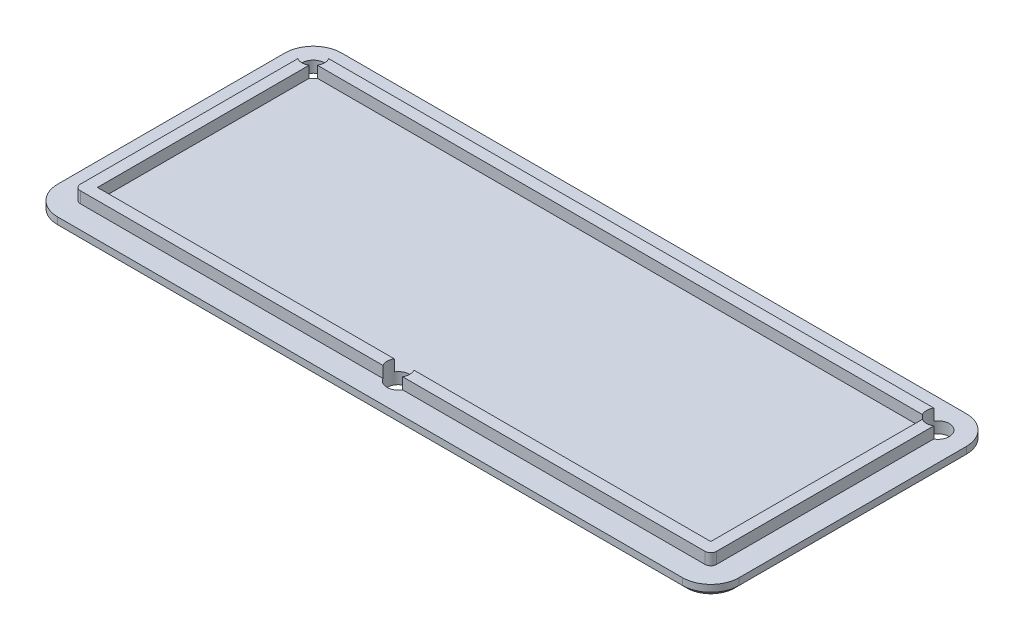
ISO-10303-21;
HEADER;
FILE_DESCRIPTION(('STEP AP214'),'2;1');
FILE_NAME('part.step','',(''),(''),'','','');
FILE_SCHEMA(('AUTOMOTIVE_DESIGN { 1 0 10303 214 1 1 1 1 }'));
ENDSEC;
DATA;
#1=APPLICATION_CONTEXT('core data for automotive mechanical design processes');
#2=APPLICATION_PROTOCOL_DEFINITION('international standard','automotive_design',2000,#1);
#3=PRODUCT_CONTEXT('',#1,'mechanical');
#4=PRODUCT('Part','Part','',(#3));
#5=PRODUCT_RELATED_PRODUCT_CATEGORY('part','',(#4));
#6=PRODUCT_DEFINITION_FORMATION('','',#4);
#7=PRODUCT_DEFINITION_CONTEXT('part definition',#1,'design');
#8=PRODUCT_DEFINITION('design','',#6,#7);
#9=PRODUCT_DEFINITION_SHAPE('','',#8);
#10=(LENGTH_UNIT() NAMED_UNIT(*) SI_UNIT(.MILLI.,.METRE.));
#11=(NAMED_UNIT(*) PLANE_ANGLE_UNIT() SI_UNIT($,.RADIAN.));
#12=(NAMED_UNIT(*) SI_UNIT($,.STERADIAN.) SOLID_ANGLE_UNIT());
#13=UNCERTAINTY_MEASURE_WITH_UNIT(LENGTH_MEASURE(1.E-05),#10,'distance_accuracy_value','');
#14=(GEOMETRIC_REPRESENTATION_CONTEXT(3) GLOBAL_UNCERTAINTY_ASSIGNED_CONTEXT((#13)) GLOBAL_UNIT_ASSIGNED_CONTEXT((#10,
#11,#12)) REPRESENTATION_CONTEXT('',''));
#15=CARTESIAN_POINT('',(0.,0.,0.));
#16=DIRECTION('',(0.,0.,1.));
#17=DIRECTION('',(1.,0.,0.));
#18=AXIS2_PLACEMENT_3D('',#15,#16,#17);
#19=CARTESIAN_POINT('',(34.925,2.54,-12.7));
#20=DIRECTION('',(0.,1.,0.));
#21=DIRECTION('',(0.,0.,1.));
#22=AXIS2_PLACEMENT_3D('',#19,#20,#21);
#23=PLANE('',#22);
#24=CARTESIAN_POINT('',(34.925,2.54,-12.7));
#25=DIRECTION('',(0.,-1.,0.));
#26=DIRECTION('',(0.,0.,-1.));
#27=AXIS2_PLACEMENT_3D('',#24,#25,#26);
#28=CIRCLE('',#27,1.27);
#29=CARTESIAN_POINT('',(33.8251477371938,2.54,-12.065));
#30=VERTEX_POINT('',#29);
#31=CARTESIAN_POINT('',(33.8251477371938,2.54,-13.335));
#32=VERTEX_POINT('',#31);
#33=EDGE_CURVE('E265',#30,#32,#28,.T.);
#34=ORIENTED_EDGE('',*,*,#33,.T.);
#35=DIRECTION('',(-1.,0.,0.));
#36=VECTOR('',#35,1.);
#37=CARTESIAN_POINT('',(34.925,2.54,-13.335));
#38=LINE('',#37,#36);
#39=CARTESIAN_POINT('',(-33.8251477371938,2.54,-13.335));
#40=VERTEX_POINT('',#39);
#41=EDGE_CURVE('E257',#32,#40,#38,.T.);
#42=ORIENTED_EDGE('',*,*,#41,.T.);
#43=CARTESIAN_POINT('',(-34.925,2.54,-12.7));
#44=DIRECTION('',(0.,-1.,0.));
#45=DIRECTION('',(0.,0.,-1.));
#46=AXIS2_PLACEMENT_3D('',#43,#44,#45);
#47=CIRCLE('',#46,1.27);
#48=CARTESIAN_POINT('',(-33.8251477371938,2.54,-12.065));
#49=VERTEX_POINT('',#48);
#50=EDGE_CURVE('E237',#40,#49,#47,.T.);
#51=ORIENTED_EDGE('',*,*,#50,.T.);
#52=DIRECTION('',(-1.,0.,0.));
#53=VECTOR('',#52,1.);
#54=CARTESIAN_POINT('',(34.29,2.54,-12.065));
#55=LINE('',#54,#53);
#56=EDGE_CURVE('E528',#30,#49,#55,.T.);
#57=ORIENTED_EDGE('',*,*,#56,.F.);
#58=EDGE_LOOP('',(#34,#42,#51,#57));
#59=FACE_BOUND('',#58,.T.);
#60=ADVANCED_FACE('F38',(#59),#23,.T.);
#61=CARTESIAN_POINT('',(35.56,2.54,-11.6001477371938));
#62=VERTEX_POINT('',#61);
#63=CARTESIAN_POINT('',(34.29,2.54,-11.6001477371938));
#64=VERTEX_POINT('',#63);
#65=EDGE_CURVE('E484',#62,#64,#28,.T.);
#66=ORIENTED_EDGE('',*,*,#65,.T.);
#67=DIRECTION('',(0.,0.,-1.));
#68=VECTOR('',#67,1.);
#69=CARTESIAN_POINT('',(34.29,2.54,12.065));
#70=LINE('',#69,#68);
#71=CARTESIAN_POINT('',(34.29,2.54,12.065));
#72=VERTEX_POINT('',#71);
#73=EDGE_CURVE('E524',#72,#64,#70,.T.);
#74=ORIENTED_EDGE('',*,*,#73,.F.);
#75=DIRECTION('',(1.,0.,0.));
#76=VECTOR('',#75,1.);
#77=CARTESIAN_POINT('',(-34.29,2.54,12.065));
#78=LINE('',#77,#76);
#79=CARTESIAN_POINT('',(1.09985226280624,2.54,12.065));
#80=VERTEX_POINT('',#79);
#81=EDGE_CURVE('E535',#80,#72,#78,.T.);
#82=ORIENTED_EDGE('',*,*,#81,.F.);
#83=CARTESIAN_POINT('',(0.,2.54,12.7));
#84=DIRECTION('',(0.,-1.,0.));
#85=DIRECTION('',(0.,0.,-1.));
#86=AXIS2_PLACEMENT_3D('',#83,#84,#85);
#87=CIRCLE('',#86,1.27);
#88=CARTESIAN_POINT('',(1.09985226280624,2.54,13.335));
#89=VERTEX_POINT('',#88);
#90=EDGE_CURVE('E600',#80,#89,#87,.T.);
#91=ORIENTED_EDGE('',*,*,#90,.T.);
#92=DIRECTION('',(1.,0.,0.));
#93=VECTOR('',#92,1.);
#94=CARTESIAN_POINT('',(-34.925,2.54,13.335));
#95=LINE('',#94,#93);
#96=CARTESIAN_POINT('',(34.925,2.54,13.335));
#97=VERTEX_POINT('',#96);
#98=EDGE_CURVE('E285',#89,#97,#95,.T.);
#99=ORIENTED_EDGE('',*,*,#98,.T.);
#100=CARTESIAN_POINT('',(34.925,2.54,12.7));
#101=DIRECTION('',(0.,1.,0.));
#102=DIRECTION('',(0.,0.,1.));
#103=AXIS2_PLACEMENT_3D('',#100,#101,#102);
#104=CIRCLE('',#103,0.634999999999998);
#105=CARTESIAN_POINT('',(35.56,2.54,12.7));
#106=VERTEX_POINT('',#105);
#107=EDGE_CURVE('E290',#97,#106,#104,.T.);
#108=ORIENTED_EDGE('',*,*,#107,.T.);
#109=DIRECTION('',(0.,0.,-1.));
#110=VECTOR('',#109,1.);
#111=CARTESIAN_POINT('',(35.56,2.54,12.7));
#112=LINE('',#111,#110);
#113=EDGE_CURVE('E293',#106,#62,#112,.T.);
#114=ORIENTED_EDGE('',*,*,#113,.T.);
#115=EDGE_LOOP('',(#66,#74,#82,#91,#99,#108,#114));
#116=FACE_BOUND('',#115,.T.);
#117=ADVANCED_FACE('F589',(#116),#23,.T.);
#118=CARTESIAN_POINT('',(-34.925,2.54,13.335));
#119=DIRECTION('',(0.,0.,-1.));
#120=DIRECTION('',(-1.,0.,0.));
#121=AXIS2_PLACEMENT_3D('',#118,#119,#120);
#122=PLANE('',#121);
#123=ORIENTED_EDGE('',*,*,#98,.F.);
#124=DIRECTION('',(0.,-1.,0.));
#125=VECTOR('',#124,1.);
#126=CARTESIAN_POINT('',(1.09985226280624,2.54,13.335));
#127=LINE('',#126,#125);
#128=CARTESIAN_POINT('',(1.09985226280624,1.27,13.335));
#129=VERTEX_POINT('',#128);
#130=EDGE_CURVE('E504',#89,#129,#127,.T.);
#131=ORIENTED_EDGE('',*,*,#130,.T.);
#132=DIRECTION('',(1.,0.,0.));
#133=VECTOR('',#132,1.);
#134=CARTESIAN_POINT('',(-34.925,1.27,13.335));
#135=LINE('',#134,#133);
#136=CARTESIAN_POINT('',(34.925,1.27,13.335));
#137=VERTEX_POINT('',#136);
#138=EDGE_CURVE('E306',#129,#137,#135,.T.);
#139=ORIENTED_EDGE('',*,*,#138,.T.);
#140=DIRECTION('',(0.,-1.,0.));
#141=VECTOR('',#140,1.);
#142=CARTESIAN_POINT('',(34.925,2.54,13.335));
#143=LINE('',#142,#141);
#144=EDGE_CURVE('E316',#97,#137,#143,.T.);
#145=ORIENTED_EDGE('',*,*,#144,.F.);
#146=EDGE_LOOP('',(#123,#131,#139,#145));
#147=FACE_BOUND('',#146,.T.);
#148=ADVANCED_FACE('F630',(#147),#122,.F.);
#149=CARTESIAN_POINT('',(-34.29,2.54,12.065));
#150=DIRECTION('',(0.,0.,-1.));
#151=DIRECTION('',(-1.,0.,0.));
#152=AXIS2_PLACEMENT_3D('',#149,#150,#151);
#153=PLANE('',#152);
#154=DIRECTION('',(0.,-1.,0.));
#155=VECTOR('',#154,1.);
#156=CARTESIAN_POINT('',(1.09985226280624,2.54,12.065));
#157=LINE('',#156,#155);
#158=CARTESIAN_POINT('',(1.09985226280624,1.27,12.065));
#159=VERTEX_POINT('',#158);
#160=EDGE_CURVE('E494',#80,#159,#157,.T.);
#161=ORIENTED_EDGE('',*,*,#160,.F.);
#162=ORIENTED_EDGE('',*,*,#81,.T.);
#163=DIRECTION('',(0.,-1.,0.));
#164=VECTOR('',#163,1.);
#165=CARTESIAN_POINT('',(34.29,2.54,12.065));
#166=LINE('',#165,#164);
#167=CARTESIAN_POINT('',(34.29,1.27,12.065));
#168=VERTEX_POINT('',#167);
#169=EDGE_CURVE('E540',#72,#168,#166,.T.);
#170=ORIENTED_EDGE('',*,*,#169,.T.);
#171=DIRECTION('',(1.,0.,0.));
#172=VECTOR('',#171,1.);
#173=CARTESIAN_POINT('',(-34.29,1.27,12.065));
#174=LINE('',#173,#172);
#175=EDGE_CURVE('E550',#159,#168,#174,.T.);
#176=ORIENTED_EDGE('',*,*,#175,.F.);
#177=EDGE_LOOP('',(#161,#162,#170,#176));
#178=FACE_BOUND('',#177,.T.);
#179=ADVANCED_FACE('F637',(#178),#153,.T.);
#180=CARTESIAN_POINT('',(0.,1.27,0.));
#181=DIRECTION('',(0.,1.,0.));
#182=DIRECTION('',(0.,0.,1.));
#183=AXIS2_PLACEMENT_3D('',#180,#181,#182);
#184=PLANE('',#183);
#185=CARTESIAN_POINT('',(34.925,1.27,-12.7));
#186=DIRECTION('',(0.,1.,0.));
#187=DIRECTION('',(0.,0.,1.));
#188=AXIS2_PLACEMENT_3D('',#185,#186,#187);
#189=CIRCLE('',#188,1.27);
#190=CARTESIAN_POINT('',(35.56,1.27,-11.6001477371938));
#191=VERTEX_POINT('',#190);
#192=CARTESIAN_POINT('',(33.8251477371938,1.27,-13.335));
#193=VERTEX_POINT('',#192);
#194=EDGE_CURVE('E518',#191,#193,#189,.T.);
#195=ORIENTED_EDGE('',*,*,#194,.F.);
#196=DIRECTION('',(0.,0.,-1.));
#197=VECTOR('',#196,1.);
#198=CARTESIAN_POINT('',(35.56,1.27,12.7));
#199=LINE('',#198,#197);
#200=CARTESIAN_POINT('',(35.56,1.27,12.7));
#201=VERTEX_POINT('',#200);
#202=EDGE_CURVE('E268',#201,#191,#199,.T.);
#203=ORIENTED_EDGE('',*,*,#202,.F.);
#204=CARTESIAN_POINT('',(34.925,1.27,12.7));
#205=DIRECTION('',(0.,1.,0.));
#206=DIRECTION('',(0.,0.,1.));
#207=AXIS2_PLACEMENT_3D('',#204,#205,#206);
#208=CIRCLE('',#207,0.634999999999998);
#209=EDGE_CURVE('E277',#137,#201,#208,.T.);
#210=ORIENTED_EDGE('',*,*,#209,.F.);
#211=ORIENTED_EDGE('',*,*,#138,.F.);
#212=CARTESIAN_POINT('',(0.,1.27,12.7));
#213=DIRECTION('',(0.,1.,0.));
#214=DIRECTION('',(0.,0.,1.));
#215=AXIS2_PLACEMENT_3D('',#212,#213,#214);
#216=CIRCLE('',#215,1.27);
#217=CARTESIAN_POINT('',(-1.09985226280624,1.27,13.335));
#218=VERTEX_POINT('',#217);
#219=EDGE_CURVE('E501',#218,#129,#216,.T.);
#220=ORIENTED_EDGE('',*,*,#219,.F.);
#221=CARTESIAN_POINT('',(-34.925,1.27,13.335));
#222=VERTEX_POINT('',#221);
#223=EDGE_CURVE('E307',#222,#218,#135,.T.);
#224=ORIENTED_EDGE('',*,*,#223,.F.);
#225=CARTESIAN_POINT('',(-34.925,1.27,12.7));
#226=DIRECTION('',(0.,1.,0.));
#227=DIRECTION('',(0.,0.,1.));
#228=AXIS2_PLACEMENT_3D('',#225,#226,#227);
#229=CIRCLE('',#228,0.634999999999998);
#230=CARTESIAN_POINT('',(-35.56,1.27,12.7));
#231=VERTEX_POINT('',#230);
#232=EDGE_CURVE('E303',#231,#222,#229,.T.);
#233=ORIENTED_EDGE('',*,*,#232,.F.);
#234=DIRECTION('',(0.,0.,1.));
#235=VECTOR('',#234,1.);
#236=CARTESIAN_POINT('',(-35.56,1.27,-12.7));
#237=LINE('',#236,#235);
#238=CARTESIAN_POINT('',(-35.56,1.27,-11.6001477371938));
#239=VERTEX_POINT('',#238);
#240=EDGE_CURVE('E300',#239,#231,#237,.T.);
#241=ORIENTED_EDGE('',*,*,#240,.F.);
#242=CARTESIAN_POINT('',(-34.925,1.27,-12.7));
#243=DIRECTION('',(0.,1.,0.));
#244=DIRECTION('',(0.,0.,1.));
#245=AXIS2_PLACEMENT_3D('',#242,#243,#244);
#246=CIRCLE('',#245,1.27);
#247=CARTESIAN_POINT('',(-33.8251477371938,1.27,-13.335));
#248=VERTEX_POINT('',#247);
#249=EDGE_CURVE('E262',#248,#239,#246,.T.);
#250=ORIENTED_EDGE('',*,*,#249,.F.);
#251=DIRECTION('',(-1.,0.,0.));
#252=VECTOR('',#251,1.);
#253=CARTESIAN_POINT('',(34.925,1.27,-13.335));
#254=LINE('',#253,#252);
#255=EDGE_CURVE('E259',#193,#248,#254,.T.);
#256=ORIENTED_EDGE('',*,*,#255,.F.);
#257=EDGE_LOOP('',(#195,#203,#210,#211,#220,#224,#233,#241,#250,#256));
#258=FACE_BOUND('',#257,.T.);
#259=DIRECTION('',(-1.,0.,0.));
#260=VECTOR('',#259,1.);
#261=CARTESIAN_POINT('',(-38.1,1.27,-15.875));
#262=LINE('',#261,#260);
#263=CARTESIAN_POINT('',(34.925,1.27,-15.875));
#264=VERTEX_POINT('',#263);
#265=CARTESIAN_POINT('',(-34.925,1.27,-15.875));
#266=VERTEX_POINT('',#265);
#267=EDGE_CURVE('E340',#264,#266,#262,.T.);
#268=ORIENTED_EDGE('',*,*,#267,.T.);
#269=CARTESIAN_POINT('',(-34.925,1.27,-12.7));
#270=DIRECTION('',(0.,1.,0.));
#271=DIRECTION('',(0.,0.,1.));
#272=AXIS2_PLACEMENT_3D('',#269,#270,#271);
#273=CIRCLE('',#272,3.175);
#274=CARTESIAN_POINT('',(-38.1,1.27,-12.7));
#275=VERTEX_POINT('',#274);
#276=EDGE_CURVE('E367',#266,#275,#273,.T.);
#277=ORIENTED_EDGE('',*,*,#276,.T.);
#278=DIRECTION('',(0.,0.,1.));
#279=VECTOR('',#278,1.);
#280=CARTESIAN_POINT('',(-38.1,1.27,-15.875));
#281=LINE('',#280,#279);
#282=CARTESIAN_POINT('',(-38.1,1.27,12.7));
#283=VERTEX_POINT('',#282);
#284=EDGE_CURVE('E328',#275,#283,#281,.T.);
#285=ORIENTED_EDGE('',*,*,#284,.T.);
#286=CARTESIAN_POINT('',(-34.925,1.27,12.7));
#287=DIRECTION('',(0.,1.,0.));
#288=DIRECTION('',(0.,0.,1.));
#289=AXIS2_PLACEMENT_3D('',#286,#287,#288);
#290=CIRCLE('',#289,3.175);
#291=CARTESIAN_POINT('',(-34.925,1.27,15.875));
#292=VERTEX_POINT('',#291);
#293=EDGE_CURVE('E358',#283,#292,#290,.T.);
#294=ORIENTED_EDGE('',*,*,#293,.T.);
#295=DIRECTION('',(1.,0.,0.));
#296=VECTOR('',#295,1.);
#297=CARTESIAN_POINT('',(-38.1,1.27,15.875));
#298=LINE('',#297,#296);
#299=CARTESIAN_POINT('',(34.925,1.27,15.875));
#300=VERTEX_POINT('',#299);
#301=EDGE_CURVE('E332',#292,#300,#298,.T.);
#302=ORIENTED_EDGE('',*,*,#301,.T.);
#303=CARTESIAN_POINT('',(34.925,1.27,12.7));
#304=DIRECTION('',(0.,1.,0.));
#305=DIRECTION('',(0.,0.,1.));
#306=AXIS2_PLACEMENT_3D('',#303,#304,#305);
#307=CIRCLE('',#306,3.175);
#308=CARTESIAN_POINT('',(38.1,1.27,12.7));
#309=VERTEX_POINT('',#308);
#310=EDGE_CURVE('E361',#300,#309,#307,.T.);
#311=ORIENTED_EDGE('',*,*,#310,.T.);
#312=DIRECTION('',(0.,0.,-1.));
#313=VECTOR('',#312,1.);
#314=CARTESIAN_POINT('',(38.1,1.27,-15.875));
#315=LINE('',#314,#313);
#316=CARTESIAN_POINT('',(38.1,1.27,-12.7));
#317=VERTEX_POINT('',#316);
#318=EDGE_CURVE('E336',#309,#317,#315,.T.);
#319=ORIENTED_EDGE('',*,*,#318,.T.);
#320=CARTESIAN_POINT('',(34.925,1.27,-12.7));
#321=DIRECTION('',(0.,1.,0.));
#322=DIRECTION('',(0.,0.,1.));
#323=AXIS2_PLACEMENT_3D('',#320,#321,#322);
#324=CIRCLE('',#323,3.175);
#325=EDGE_CURVE('E364',#317,#264,#324,.T.);
#326=ORIENTED_EDGE('',*,*,#325,.T.);
#327=EDGE_LOOP('',(#268,#277,#285,#294,#302,#311,#319,#326));
#328=FACE_BOUND('',#327,.T.);
#329=ADVANCED_FACE('F623',(#258,#328),#184,.T.);
#330=CARTESIAN_POINT('',(-38.1,1.27,-15.875));
#331=DIRECTION('',(1.,0.,0.));
#332=DIRECTION('',(0.,0.,-1.));
#333=AXIS2_PLACEMENT_3D('',#330,#331,#332);
#334=PLANE('',#333);
#335=DIRECTION('',(0.,-1.,0.));
#336=VECTOR('',#335,1.);
#337=CARTESIAN_POINT('',(-38.1,1.27,-12.7));
#338=LINE('',#337,#336);
#339=CARTESIAN_POINT('',(-38.1,0.508000000000002,-12.7));
#340=VERTEX_POINT('',#339);
#341=EDGE_CURVE('E347',#275,#340,#338,.T.);
#342=ORIENTED_EDGE('',*,*,#341,.T.);
#343=DIRECTION('',(0.,0.,1.));
#344=VECTOR('',#343,1.);
#345=CARTESIAN_POINT('',(-38.1,0.508000000000002,-15.875));
#346=LINE('',#345,#344);
#347=CARTESIAN_POINT('',(-38.1,0.508000000000002,12.7));
#348=VERTEX_POINT('',#347);
#349=EDGE_CURVE('E427',#340,#348,#346,.T.);
#350=ORIENTED_EDGE('',*,*,#349,.T.);
#351=DIRECTION('',(0.,-1.,0.));
#352=VECTOR('',#351,1.);
#353=CARTESIAN_POINT('',(-38.1,1.27,12.7));
#354=LINE('',#353,#352);
#355=EDGE_CURVE('E344',#348,#283,#354,.F.);
#356=ORIENTED_EDGE('',*,*,#355,.T.);
#357=ORIENTED_EDGE('',*,*,#284,.F.);
#358=EDGE_LOOP('',(#342,#350,#356,#357));
#359=FACE_BOUND('',#358,.T.);
#360=ADVANCED_FACE('F645',(#359),#334,.F.);
#361=CARTESIAN_POINT('',(-38.1,1.27,15.875));
#362=DIRECTION('',(0.,0.,-1.));
#363=DIRECTION('',(-1.,0.,0.));
#364=AXIS2_PLACEMENT_3D('',#361,#362,#363);
#365=PLANE('',#364);
#366=DIRECTION('',(0.,-1.,0.));
#367=VECTOR('',#366,1.);
#368=CARTESIAN_POINT('',(-34.925,1.27,15.875));
#369=LINE('',#368,#367);
#370=CARTESIAN_POINT('',(-34.925,0.508000000000002,15.875));
#371=VERTEX_POINT('',#370);
#372=EDGE_CURVE('E377',#292,#371,#369,.T.);
#373=ORIENTED_EDGE('',*,*,#372,.T.);
#374=DIRECTION('',(1.,0.,0.));
#375=VECTOR('',#374,1.);
#376=CARTESIAN_POINT('',(-38.1,0.508000000000002,15.875));
#377=LINE('',#376,#375);
#378=CARTESIAN_POINT('',(34.925,0.508000000000002,15.875));
#379=VERTEX_POINT('',#378);
#380=EDGE_CURVE('E11',#371,#379,#377,.T.);
#381=ORIENTED_EDGE('',*,*,#380,.T.);
#382=DIRECTION('',(0.,-1.,0.));
#383=VECTOR('',#382,1.);
#384=CARTESIAN_POINT('',(34.925,1.27,15.875));
#385=LINE('',#384,#383);
#386=EDGE_CURVE('E380',#379,#300,#385,.F.);
#387=ORIENTED_EDGE('',*,*,#386,.T.);
#388=ORIENTED_EDGE('',*,*,#301,.F.);
#389=EDGE_LOOP('',(#373,#381,#387,#388));
#390=FACE_BOUND('',#389,.T.);
#391=ADVANCED_FACE('F750',(#390),#365,.F.);
#392=CARTESIAN_POINT('',(38.1,1.27,-15.875));
#393=DIRECTION('',(-1.,0.,0.));
#394=DIRECTION('',(0.,0.,1.));
#395=AXIS2_PLACEMENT_3D('',#392,#393,#394);
#396=PLANE('',#395);
#397=DIRECTION('',(0.,-1.,0.));
#398=VECTOR('',#397,1.);
#399=CARTESIAN_POINT('',(38.1,1.27,12.7));
#400=LINE('',#399,#398);
#401=CARTESIAN_POINT('',(38.1,0.508000000000001,12.7));
#402=VERTEX_POINT('',#401);
#403=EDGE_CURVE('E370',#309,#402,#400,.T.);
#404=ORIENTED_EDGE('',*,*,#403,.T.);
#405=DIRECTION('',(0.,0.,-1.));
#406=VECTOR('',#405,1.);
#407=CARTESIAN_POINT('',(38.1,0.508000000000002,-15.875));
#408=LINE('',#407,#406);
#409=CARTESIAN_POINT('',(38.1,0.508000000000002,-12.7));
#410=VERTEX_POINT('',#409);
#411=EDGE_CURVE('E430',#402,#410,#408,.T.);
#412=ORIENTED_EDGE('',*,*,#411,.T.);
#413=DIRECTION('',(0.,-1.,0.));
#414=VECTOR('',#413,1.);
#415=CARTESIAN_POINT('',(38.1,1.27,-12.7));
#416=LINE('',#415,#414);
#417=EDGE_CURVE('E374',#410,#317,#416,.F.);
#418=ORIENTED_EDGE('',*,*,#417,.T.);
#419=ORIENTED_EDGE('',*,*,#318,.F.);
#420=EDGE_LOOP('',(#404,#412,#418,#419));
#421=FACE_BOUND('',#420,.T.);
#422=ADVANCED_FACE('F723',(#421),#396,.F.);
#423=CARTESIAN_POINT('',(-38.1,1.27,-15.875));
#424=DIRECTION('',(0.,0.,1.));
#425=DIRECTION('',(1.,0.,0.));
#426=AXIS2_PLACEMENT_3D('',#423,#424,#425);
#427=PLANE('',#426);
#428=DIRECTION('',(0.,-1.,0.));
#429=VECTOR('',#428,1.);
#430=CARTESIAN_POINT('',(34.925,1.27,-15.875));
#431=LINE('',#430,#429);
#432=CARTESIAN_POINT('',(34.925,0.508000000000002,-15.875));
#433=VERTEX_POINT('',#432);
#434=EDGE_CURVE('E351',#264,#433,#431,.T.);
#435=ORIENTED_EDGE('',*,*,#434,.T.);
#436=DIRECTION('',(-1.,0.,0.));
#437=VECTOR('',#436,1.);
#438=CARTESIAN_POINT('',(-38.1,0.508000000000002,-15.875));
#439=LINE('',#438,#437);
#440=CARTESIAN_POINT('',(-34.925,0.508000000000001,-15.875));
#441=VERTEX_POINT('',#440);
#442=EDGE_CURVE('E392',#433,#441,#439,.T.);
#443=ORIENTED_EDGE('',*,*,#442,.T.);
#444=DIRECTION('',(0.,-1.,0.));
#445=VECTOR('',#444,1.);
#446=CARTESIAN_POINT('',(-34.925,1.27,-15.875));
#447=LINE('',#446,#445);
#448=EDGE_CURVE('E355',#441,#266,#447,.F.);
#449=ORIENTED_EDGE('',*,*,#448,.T.);
#450=ORIENTED_EDGE('',*,*,#267,.F.);
#451=EDGE_LOOP('',(#435,#443,#449,#450));
#452=FACE_BOUND('',#451,.T.);
#453=ADVANCED_FACE('F732',(#452),#427,.F.);
#454=CARTESIAN_POINT('',(0.,0.,0.));
#455=DIRECTION('',(0.,1.,0.));
#456=DIRECTION('',(0.,0.,1.));
#457=AXIS2_PLACEMENT_3D('',#454,#455,#456);
#458=PLANE('',#457);
#459=CARTESIAN_POINT('',(-34.925,0.,-12.7));
#460=DIRECTION('',(0.,1.,0.));
#461=DIRECTION('',(0.,0.,1.));
#462=AXIS2_PLACEMENT_3D('',#459,#460,#461);
#463=CIRCLE('',#462,2.66699999999999);
#464=CARTESIAN_POINT('',(-37.592,0.,-12.7));
#465=VERTEX_POINT('',#464);
#466=CARTESIAN_POINT('',(-34.925,0.,-15.367));
#467=VERTEX_POINT('',#466);
#468=EDGE_CURVE('E414',#465,#467,#463,.F.);
#469=ORIENTED_EDGE('',*,*,#468,.T.);
#470=DIRECTION('',(1.,0.,0.));
#471=VECTOR('',#470,1.);
#472=CARTESIAN_POINT('',(0.,0.,-15.367));
#473=LINE('',#472,#471);
#474=CARTESIAN_POINT('',(34.925,0.,-15.367));
#475=VERTEX_POINT('',#474);
#476=EDGE_CURVE('E417',#467,#475,#473,.T.);
#477=ORIENTED_EDGE('',*,*,#476,.T.);
#478=CARTESIAN_POINT('',(34.925,0.,-12.7));
#479=DIRECTION('',(0.,1.,0.));
#480=DIRECTION('',(0.,0.,1.));
#481=AXIS2_PLACEMENT_3D('',#478,#479,#480);
#482=CIRCLE('',#481,2.66699999999999);
#483=CARTESIAN_POINT('',(37.592,0.,-12.7));
#484=VERTEX_POINT('',#483);
#485=EDGE_CURVE('E411',#475,#484,#482,.F.);
#486=ORIENTED_EDGE('',*,*,#485,.T.);
#487=DIRECTION('',(0.,0.,1.));
#488=VECTOR('',#487,1.);
#489=CARTESIAN_POINT('',(37.592,0.,0.));
#490=LINE('',#489,#488);
#491=CARTESIAN_POINT('',(37.592,0.,12.7));
#492=VERTEX_POINT('',#491);
#493=EDGE_CURVE('E405',#484,#492,#490,.T.);
#494=ORIENTED_EDGE('',*,*,#493,.T.);
#495=CARTESIAN_POINT('',(34.925,0.,12.7));
#496=DIRECTION('',(0.,1.,0.));
#497=DIRECTION('',(0.,0.,1.));
#498=AXIS2_PLACEMENT_3D('',#495,#496,#497);
#499=CIRCLE('',#498,2.66699999999999);
#500=CARTESIAN_POINT('',(34.925,0.,15.367));
#501=VERTEX_POINT('',#500);
#502=EDGE_CURVE('E399',#492,#501,#499,.F.);
#503=ORIENTED_EDGE('',*,*,#502,.T.);
#504=DIRECTION('',(-1.,0.,0.));
#505=VECTOR('',#504,1.);
#506=CARTESIAN_POINT('',(0.,0.,15.367));
#507=LINE('',#506,#505);
#508=CARTESIAN_POINT('',(-34.925,0.,15.367));
#509=VERTEX_POINT('',#508);
#510=EDGE_CURVE('E396',#501,#509,#507,.T.);
#511=ORIENTED_EDGE('',*,*,#510,.T.);
#512=CARTESIAN_POINT('',(-34.925,0.,12.7));
#513=DIRECTION('',(0.,1.,0.));
#514=DIRECTION('',(0.,0.,1.));
#515=AXIS2_PLACEMENT_3D('',#512,#513,#514);
#516=CIRCLE('',#515,2.66699999999999);
#517=CARTESIAN_POINT('',(-37.592,0.,12.7));
#518=VERTEX_POINT('',#517);
#519=EDGE_CURVE('E402',#509,#518,#516,.F.);
#520=ORIENTED_EDGE('',*,*,#519,.T.);
#521=DIRECTION('',(0.,0.,-1.));
#522=VECTOR('',#521,1.);
#523=CARTESIAN_POINT('',(-37.592,0.,0.));
#524=LINE('',#523,#522);
#525=EDGE_CURVE('E408',#518,#465,#524,.T.);
#526=ORIENTED_EDGE('',*,*,#525,.T.);
#527=EDGE_LOOP('',(#469,#477,#486,#494,#503,#511,#520,#526));
#528=FACE_BOUND('',#527,.T.);
#529=CARTESIAN_POINT('',(34.925,0.,-12.7));
#530=DIRECTION('',(0.,-1.,0.));
#531=DIRECTION('',(0.,0.,-1.));
#532=AXIS2_PLACEMENT_3D('',#529,#530,#531);
#533=CIRCLE('',#532,1.27);
#534=CARTESIAN_POINT('',(34.925,0.,-13.97));
#535=VERTEX_POINT('',#534);
#536=EDGE_CURVE('E595',#535,#535,#533,.T.);
#537=ORIENTED_EDGE('',*,*,#536,.F.);
#538=EDGE_LOOP('',(#537));
#539=FACE_BOUND('',#538,.T.);
#540=CARTESIAN_POINT('',(0.,0.,12.7));
#541=DIRECTION('',(0.,-1.,0.));
#542=DIRECTION('',(0.,0.,-1.));
#543=AXIS2_PLACEMENT_3D('',#540,#541,#542);
#544=CIRCLE('',#543,1.27);
#545=CARTESIAN_POINT('',(0.,0.,11.43));
#546=VERTEX_POINT('',#545);
#547=EDGE_CURVE('E249',#546,#546,#544,.T.);
#548=ORIENTED_EDGE('',*,*,#547,.F.);
#549=EDGE_LOOP('',(#548));
#550=FACE_BOUND('',#549,.T.);
#551=CARTESIAN_POINT('',(-34.925,0.,-12.7));
#552=DIRECTION('',(0.,-1.,0.));
#553=DIRECTION('',(0.,0.,-1.));
#554=AXIS2_PLACEMENT_3D('',#551,#552,#553);
#555=CIRCLE('',#554,1.27);
#556=CARTESIAN_POINT('',(-34.925,0.,-13.97));
#557=VERTEX_POINT('',#556);
#558=EDGE_CURVE('E467',#557,#557,#555,.T.);
#559=ORIENTED_EDGE('',*,*,#558,.F.);
#560=EDGE_LOOP('',(#559));
#561=FACE_BOUND('',#560,.T.);
#562=ADVANCED_FACE('F713',(#528,#539,#550,#561),#458,.F.);
#563=CARTESIAN_POINT('',(-34.925,1.27,-12.7));
#564=DIRECTION('',(0.,-1.,0.));
#565=DIRECTION('',(0.,0.,-1.));
#566=AXIS2_PLACEMENT_3D('',#563,#564,#565);
#567=CYLINDRICAL_SURFACE('',#566,3.175);
#568=ORIENTED_EDGE('',*,*,#448,.F.);
#569=CARTESIAN_POINT('',(-34.925,0.508000000000001,-12.7));
#570=DIRECTION('',(0.,1.,0.));
#571=DIRECTION('',(0.,0.,1.));
#572=AXIS2_PLACEMENT_3D('',#569,#570,#571);
#573=CIRCLE('',#572,3.175);
#574=EDGE_CURVE('E421',#441,#340,#573,.T.);
#575=ORIENTED_EDGE('',*,*,#574,.T.);
#576=ORIENTED_EDGE('',*,*,#341,.F.);
#577=ORIENTED_EDGE('',*,*,#276,.F.);
#578=EDGE_LOOP('',(#568,#575,#576,#577));
#579=FACE_BOUND('',#578,.T.);
#580=ADVANCED_FACE('F737',(#579),#567,.T.);
#581=CARTESIAN_POINT('',(34.925,1.27,-12.7));
#582=DIRECTION('',(0.,-1.,0.));
#583=DIRECTION('',(0.,0.,-1.));
#584=AXIS2_PLACEMENT_3D('',#581,#582,#583);
#585=CYLINDRICAL_SURFACE('',#584,3.175);
#586=ORIENTED_EDGE('',*,*,#417,.F.);
#587=CARTESIAN_POINT('',(34.925,0.508000000000002,-12.7));
#588=DIRECTION('',(0.,1.,0.));
#589=DIRECTION('',(0.,0.,1.));
#590=AXIS2_PLACEMENT_3D('',#587,#588,#589);
#591=CIRCLE('',#590,3.175);
#592=EDGE_CURVE('E424',#410,#433,#591,.T.);
#593=ORIENTED_EDGE('',*,*,#592,.T.);
#594=ORIENTED_EDGE('',*,*,#434,.F.);
#595=ORIENTED_EDGE('',*,*,#325,.F.);
#596=EDGE_LOOP('',(#586,#593,#594,#595));
#597=FACE_BOUND('',#596,.T.);
#598=ADVANCED_FACE('F671',(#597),#585,.T.);
#599=CARTESIAN_POINT('',(34.925,1.27,12.7));
#600=DIRECTION('',(0.,-1.,0.));
#601=DIRECTION('',(0.,0.,-1.));
#602=AXIS2_PLACEMENT_3D('',#599,#600,#601);
#603=CYLINDRICAL_SURFACE('',#602,3.175);
#604=ORIENTED_EDGE('',*,*,#386,.F.);
#605=CARTESIAN_POINT('',(34.925,0.508000000000001,12.7));
#606=DIRECTION('',(0.,1.,0.));
#607=DIRECTION('',(0.,0.,1.));
#608=AXIS2_PLACEMENT_3D('',#605,#606,#607);
#609=CIRCLE('',#608,3.175);
#610=EDGE_CURVE('E48',#379,#402,#609,.T.);
#611=ORIENTED_EDGE('',*,*,#610,.T.);
#612=ORIENTED_EDGE('',*,*,#403,.F.);
#613=ORIENTED_EDGE('',*,*,#310,.F.);
#614=EDGE_LOOP('',(#604,#611,#612,#613));
#615=FACE_BOUND('',#614,.T.);
#616=ADVANCED_FACE('F666',(#615),#603,.T.);
#617=CARTESIAN_POINT('',(-34.925,1.27,12.7));
#618=DIRECTION('',(0.,-1.,0.));
#619=DIRECTION('',(0.,0.,-1.));
#620=AXIS2_PLACEMENT_3D('',#617,#618,#619);
#621=CYLINDRICAL_SURFACE('',#620,3.175);
#622=ORIENTED_EDGE('',*,*,#355,.F.);
#623=CARTESIAN_POINT('',(-34.925,0.508000000000002,12.7));
#624=DIRECTION('',(0.,1.,0.));
#625=DIRECTION('',(0.,0.,1.));
#626=AXIS2_PLACEMENT_3D('',#623,#624,#625);
#627=CIRCLE('',#626,3.175);
#628=EDGE_CURVE('E62',#348,#371,#627,.T.);
#629=ORIENTED_EDGE('',*,*,#628,.T.);
#630=ORIENTED_EDGE('',*,*,#372,.F.);
#631=ORIENTED_EDGE('',*,*,#293,.F.);
#632=EDGE_LOOP('',(#622,#629,#630,#631));
#633=FACE_BOUND('',#632,.T.);
#634=ADVANCED_FACE('F659',(#633),#621,.T.);
#635=CARTESIAN_POINT('',(-1.09985226280624,2.54,13.335));
#636=VERTEX_POINT('',#635);
#637=CARTESIAN_POINT('',(-1.09985226280624,2.54,12.065));
#638=VERTEX_POINT('',#637);
#639=EDGE_CURVE('E603',#636,#638,#87,.T.);
#640=ORIENTED_EDGE('',*,*,#639,.T.);
#641=CARTESIAN_POINT('',(-34.29,2.54,12.065));
#642=VERTEX_POINT('',#641);
#643=EDGE_CURVE('E536',#642,#638,#78,.T.);
#644=ORIENTED_EDGE('',*,*,#643,.F.);
#645=DIRECTION('',(0.,0.,1.));
#646=VECTOR('',#645,1.);
#647=CARTESIAN_POINT('',(-34.29,2.54,-12.065));
#648=LINE('',#647,#646);
#649=CARTESIAN_POINT('',(-34.29,2.54,-11.6001477371938));
#650=VERTEX_POINT('',#649);
#651=EDGE_CURVE('E532',#650,#642,#648,.T.);
#652=ORIENTED_EDGE('',*,*,#651,.F.);
#653=CARTESIAN_POINT('',(-35.56,2.54,-11.6001477371938));
#654=VERTEX_POINT('',#653);
#655=EDGE_CURVE('E250',#650,#654,#47,.T.);
#656=ORIENTED_EDGE('',*,*,#655,.T.);
#657=DIRECTION('',(0.,0.,1.));
#658=VECTOR('',#657,1.);
#659=CARTESIAN_POINT('',(-35.56,2.54,-12.7));
#660=LINE('',#659,#658);
#661=CARTESIAN_POINT('',(-35.56,2.54,12.7));
#662=VERTEX_POINT('',#661);
#663=EDGE_CURVE('E267',#654,#662,#660,.T.);
#664=ORIENTED_EDGE('',*,*,#663,.T.);
#665=CARTESIAN_POINT('',(-34.925,2.54,12.7));
#666=DIRECTION('',(0.,1.,0.));
#667=DIRECTION('',(0.,0.,1.));
#668=AXIS2_PLACEMENT_3D('',#665,#666,#667);
#669=CIRCLE('',#668,0.634999999999998);
#670=CARTESIAN_POINT('',(-34.925,2.54,13.335));
#671=VERTEX_POINT('',#670);
#672=EDGE_CURVE('E273',#662,#671,#669,.T.);
#673=ORIENTED_EDGE('',*,*,#672,.T.);
#674=EDGE_CURVE('E286',#671,#636,#95,.T.);
#675=ORIENTED_EDGE('',*,*,#674,.T.);
#676=EDGE_LOOP('',(#640,#644,#652,#656,#664,#673,#675));
#677=FACE_BOUND('',#676,.T.);
#678=ADVANCED_FACE('F611',(#677),#23,.T.);
#679=CARTESIAN_POINT('',(34.925,2.54,-13.335));
#680=DIRECTION('',(0.,0.,1.));
#681=DIRECTION('',(1.,0.,0.));
#682=AXIS2_PLACEMENT_3D('',#679,#680,#681);
#683=PLANE('',#682);
#684=ORIENTED_EDGE('',*,*,#41,.F.);
#685=DIRECTION('',(0.,-1.,0.));
#686=VECTOR('',#685,1.);
#687=CARTESIAN_POINT('',(33.8251477371938,2.54,-13.335));
#688=LINE('',#687,#686);
#689=EDGE_CURVE('E520',#32,#193,#688,.T.);
#690=ORIENTED_EDGE('',*,*,#689,.T.);
#691=ORIENTED_EDGE('',*,*,#255,.T.);
#692=DIRECTION('',(0.,-1.,0.));
#693=VECTOR('',#692,1.);
#694=CARTESIAN_POINT('',(-33.8251477371938,2.54,-13.335));
#695=LINE('',#694,#693);
#696=EDGE_CURVE('E240',#248,#40,#695,.F.);
#697=ORIENTED_EDGE('',*,*,#696,.T.);
#698=EDGE_LOOP('',(#684,#690,#691,#697));
#699=FACE_BOUND('',#698,.T.);
#700=ADVANCED_FACE('F255',(#699),#683,.F.);
#701=CARTESIAN_POINT('',(-35.56,2.54,-12.7));
#702=DIRECTION('',(1.,0.,0.));
#703=DIRECTION('',(0.,0.,-1.));
#704=AXIS2_PLACEMENT_3D('',#701,#702,#703);
#705=PLANE('',#704);
#706=ORIENTED_EDGE('',*,*,#663,.F.);
#707=DIRECTION('',(0.,-1.,0.));
#708=VECTOR('',#707,1.);
#709=CARTESIAN_POINT('',(-35.56,2.54,-11.6001477371938));
#710=LINE('',#709,#708);
#711=EDGE_CURVE('E486',#654,#239,#710,.T.);
#712=ORIENTED_EDGE('',*,*,#711,.T.);
#713=ORIENTED_EDGE('',*,*,#240,.T.);
#714=DIRECTION('',(0.,-1.,0.));
#715=VECTOR('',#714,1.);
#716=CARTESIAN_POINT('',(-35.56,2.54,12.7));
#717=LINE('',#716,#715);
#718=EDGE_CURVE('E324',#662,#231,#717,.T.);
#719=ORIENTED_EDGE('',*,*,#718,.F.);
#720=EDGE_LOOP('',(#706,#712,#713,#719));
#721=FACE_BOUND('',#720,.T.);
#722=ADVANCED_FACE('F664',(#721),#705,.F.);
#723=CARTESIAN_POINT('',(-34.925,2.54,12.7));
#724=DIRECTION('',(0.,-1.,0.));
#725=DIRECTION('',(0.,0.,-1.));
#726=AXIS2_PLACEMENT_3D('',#723,#724,#725);
#727=CYLINDRICAL_SURFACE('',#726,0.634999999999998);
#728=ORIENTED_EDGE('',*,*,#232,.T.);
#729=DIRECTION('',(0.,-1.,0.));
#730=VECTOR('',#729,1.);
#731=CARTESIAN_POINT('',(-34.925,2.54,13.335));
#732=LINE('',#731,#730);
#733=EDGE_CURVE('E320',#671,#222,#732,.T.);
#734=ORIENTED_EDGE('',*,*,#733,.F.);
#735=ORIENTED_EDGE('',*,*,#672,.F.);
#736=ORIENTED_EDGE('',*,*,#718,.T.);
#737=EDGE_LOOP('',(#728,#734,#735,#736));
#738=FACE_BOUND('',#737,.T.);
#739=ADVANCED_FACE('F791',(#738),#727,.T.);
#740=ORIENTED_EDGE('',*,*,#223,.T.);
#741=DIRECTION('',(0.,-1.,0.));
#742=VECTOR('',#741,1.);
#743=CARTESIAN_POINT('',(-1.09985226280624,2.54,13.335));
#744=LINE('',#743,#742);
#745=EDGE_CURVE('E497',#218,#636,#744,.F.);
#746=ORIENTED_EDGE('',*,*,#745,.T.);
#747=ORIENTED_EDGE('',*,*,#674,.F.);
#748=ORIENTED_EDGE('',*,*,#733,.T.);
#749=EDGE_LOOP('',(#740,#746,#747,#748));
#750=FACE_BOUND('',#749,.T.);
#751=ADVANCED_FACE('F617',(#750),#122,.F.);
#752=CARTESIAN_POINT('',(34.925,2.54,12.7));
#753=DIRECTION('',(0.,-1.,0.));
#754=DIRECTION('',(0.,0.,-1.));
#755=AXIS2_PLACEMENT_3D('',#752,#753,#754);
#756=CYLINDRICAL_SURFACE('',#755,0.634999999999998);
#757=ORIENTED_EDGE('',*,*,#209,.T.);
#758=DIRECTION('',(0.,-1.,0.));
#759=VECTOR('',#758,1.);
#760=CARTESIAN_POINT('',(35.56,2.54,12.7));
#761=LINE('',#760,#759);
#762=EDGE_CURVE('E297',#106,#201,#761,.T.);
#763=ORIENTED_EDGE('',*,*,#762,.F.);
#764=ORIENTED_EDGE('',*,*,#107,.F.);
#765=ORIENTED_EDGE('',*,*,#144,.T.);
#766=EDGE_LOOP('',(#757,#763,#764,#765));
#767=FACE_BOUND('',#766,.T.);
#768=ADVANCED_FACE('F809',(#767),#756,.T.);
#769=CARTESIAN_POINT('',(35.56,2.54,12.7));
#770=DIRECTION('',(-1.,0.,0.));
#771=DIRECTION('',(0.,0.,1.));
#772=AXIS2_PLACEMENT_3D('',#769,#770,#771);
#773=PLANE('',#772);
#774=ORIENTED_EDGE('',*,*,#202,.T.);
#775=DIRECTION('',(0.,-1.,0.));
#776=VECTOR('',#775,1.);
#777=CARTESIAN_POINT('',(35.56,2.54,-11.6001477371938));
#778=LINE('',#777,#776);
#779=EDGE_CURVE('E514',#191,#62,#778,.F.);
#780=ORIENTED_EDGE('',*,*,#779,.T.);
#781=ORIENTED_EDGE('',*,*,#113,.F.);
#782=ORIENTED_EDGE('',*,*,#762,.T.);
#783=EDGE_LOOP('',(#774,#780,#781,#782));
#784=FACE_BOUND('',#783,.T.);
#785=ADVANCED_FACE('F816',(#784),#773,.F.);
#786=CARTESIAN_POINT('',(34.29,2.54,12.065));
#787=DIRECTION('',(-1.,0.,0.));
#788=DIRECTION('',(0.,0.,1.));
#789=AXIS2_PLACEMENT_3D('',#786,#787,#788);
#790=PLANE('',#789);
#791=DIRECTION('',(0.,-1.,0.));
#792=VECTOR('',#791,1.);
#793=CARTESIAN_POINT('',(34.29,2.54,-11.6001477371938));
#794=LINE('',#793,#792);
#795=CARTESIAN_POINT('',(34.29,1.27,-11.6001477371938));
#796=VERTEX_POINT('',#795);
#797=EDGE_CURVE('E511',#796,#64,#794,.F.);
#798=ORIENTED_EDGE('',*,*,#797,.F.);
#799=DIRECTION('',(0.,0.,-1.));
#800=VECTOR('',#799,1.);
#801=CARTESIAN_POINT('',(34.29,1.27,12.065));
#802=LINE('',#801,#800);
#803=EDGE_CURVE('E523',#168,#796,#802,.T.);
#804=ORIENTED_EDGE('',*,*,#803,.F.);
#805=ORIENTED_EDGE('',*,*,#169,.F.);
#806=ORIENTED_EDGE('',*,*,#73,.T.);
#807=EDGE_LOOP('',(#798,#804,#805,#806));
#808=FACE_BOUND('',#807,.T.);
#809=ADVANCED_FACE('F585',(#808),#790,.T.);
#810=CARTESIAN_POINT('',(34.29,2.54,-12.065));
#811=DIRECTION('',(0.,0.,1.));
#812=DIRECTION('',(1.,0.,0.));
#813=AXIS2_PLACEMENT_3D('',#810,#811,#812);
#814=PLANE('',#813);
#815=DIRECTION('',(0.,-1.,0.));
#816=VECTOR('',#815,1.);
#817=CARTESIAN_POINT('',(33.8251477371938,2.54,-12.065));
#818=LINE('',#817,#816);
#819=CARTESIAN_POINT('',(33.8251477371938,1.27,-12.065));
#820=VERTEX_POINT('',#819);
#821=EDGE_CURVE('E508',#30,#820,#818,.T.);
#822=ORIENTED_EDGE('',*,*,#821,.F.);
#823=ORIENTED_EDGE('',*,*,#56,.T.);
#824=DIRECTION('',(0.,-1.,0.));
#825=VECTOR('',#824,1.);
#826=CARTESIAN_POINT('',(-33.8251477371938,2.54,-12.065));
#827=LINE('',#826,#825);
#828=CARTESIAN_POINT('',(-33.8251477371938,1.27,-12.065));
#829=VERTEX_POINT('',#828);
#830=EDGE_CURVE('E243',#829,#49,#827,.F.);
#831=ORIENTED_EDGE('',*,*,#830,.F.);
#832=DIRECTION('',(-1.,0.,0.));
#833=VECTOR('',#832,1.);
#834=CARTESIAN_POINT('',(34.29,1.27,-12.065));
#835=LINE('',#834,#833);
#836=EDGE_CURVE('E544',#820,#829,#835,.T.);
#837=ORIENTED_EDGE('',*,*,#836,.F.);
#838=EDGE_LOOP('',(#822,#823,#831,#837));
#839=FACE_BOUND('',#838,.T.);
#840=ADVANCED_FACE('F579',(#839),#814,.T.);
#841=CARTESIAN_POINT('',(-34.29,2.54,-12.065));
#842=DIRECTION('',(1.,0.,0.));
#843=DIRECTION('',(0.,0.,-1.));
#844=AXIS2_PLACEMENT_3D('',#841,#842,#843);
#845=PLANE('',#844);
#846=DIRECTION('',(0.,-1.,0.));
#847=VECTOR('',#846,1.);
#848=CARTESIAN_POINT('',(-34.29,2.54,-11.6001477371938));
#849=LINE('',#848,#847);
#850=CARTESIAN_POINT('',(-34.29,1.27,-11.6001477371938));
#851=VERTEX_POINT('',#850);
#852=EDGE_CURVE('E482',#650,#851,#849,.T.);
#853=ORIENTED_EDGE('',*,*,#852,.F.);
#854=ORIENTED_EDGE('',*,*,#651,.T.);
#855=DIRECTION('',(0.,-1.,0.));
#856=VECTOR('',#855,1.);
#857=CARTESIAN_POINT('',(-34.29,2.54,12.065));
#858=LINE('',#857,#856);
#859=CARTESIAN_POINT('',(-34.29,1.27,12.065));
#860=VERTEX_POINT('',#859);
#861=EDGE_CURVE('E280',#642,#860,#858,.T.);
#862=ORIENTED_EDGE('',*,*,#861,.T.);
#863=DIRECTION('',(0.,0.,1.));
#864=VECTOR('',#863,1.);
#865=CARTESIAN_POINT('',(-34.29,1.27,-12.065));
#866=LINE('',#865,#864);
#867=EDGE_CURVE('E547',#851,#860,#866,.T.);
#868=ORIENTED_EDGE('',*,*,#867,.F.);
#869=EDGE_LOOP('',(#853,#854,#862,#868));
#870=FACE_BOUND('',#869,.T.);
#871=ADVANCED_FACE('F565',(#870),#845,.T.);
#872=DIRECTION('',(0.,-1.,0.));
#873=VECTOR('',#872,1.);
#874=CARTESIAN_POINT('',(-1.09985226280624,2.54,12.065));
#875=LINE('',#874,#873);
#876=CARTESIAN_POINT('',(-1.09985226280624,1.27,12.065));
#877=VERTEX_POINT('',#876);
#878=EDGE_CURVE('E261',#877,#638,#875,.F.);
#879=ORIENTED_EDGE('',*,*,#878,.F.);
#880=EDGE_CURVE('E529',#860,#877,#174,.T.);
#881=ORIENTED_EDGE('',*,*,#880,.F.);
#882=ORIENTED_EDGE('',*,*,#861,.F.);
#883=ORIENTED_EDGE('',*,*,#643,.T.);
#884=EDGE_LOOP('',(#879,#881,#882,#883));
#885=FACE_BOUND('',#884,.T.);
#886=ADVANCED_FACE('F570',(#885),#153,.T.);
#887=CARTESIAN_POINT('',(34.925,1.27,-12.7));
#888=DIRECTION('',(0.,1.,0.));
#889=DIRECTION('',(0.,0.,1.));
#890=AXIS2_PLACEMENT_3D('',#887,#888,#889);
#891=CIRCLE('',#890,1.27);
#892=EDGE_CURVE('E389',#820,#796,#891,.T.);
#893=ORIENTED_EDGE('',*,*,#892,.F.);
#894=ORIENTED_EDGE('',*,*,#836,.T.);
#895=CARTESIAN_POINT('',(-34.925,1.27,-12.7));
#896=DIRECTION('',(0.,1.,0.));
#897=DIRECTION('',(0.,0.,1.));
#898=AXIS2_PLACEMENT_3D('',#895,#896,#897);
#899=CIRCLE('',#898,1.27);
#900=EDGE_CURVE('E383',#851,#829,#899,.T.);
#901=ORIENTED_EDGE('',*,*,#900,.F.);
#902=ORIENTED_EDGE('',*,*,#867,.T.);
#903=ORIENTED_EDGE('',*,*,#880,.T.);
#904=CARTESIAN_POINT('',(0.,1.27,12.7));
#905=DIRECTION('',(0.,1.,0.));
#906=DIRECTION('',(0.,0.,1.));
#907=AXIS2_PLACEMENT_3D('',#904,#905,#906);
#908=CIRCLE('',#907,1.27);
#909=EDGE_CURVE('E386',#159,#877,#908,.T.);
#910=ORIENTED_EDGE('',*,*,#909,.F.);
#911=ORIENTED_EDGE('',*,*,#175,.T.);
#912=ORIENTED_EDGE('',*,*,#803,.T.);
#913=EDGE_LOOP('',(#893,#894,#901,#902,#903,#910,#911,#912));
#914=FACE_BOUND('',#913,.T.);
#915=ADVANCED_FACE('F574',(#914),#184,.T.);
#916=CARTESIAN_POINT('',(-34.925,2.54,-12.7));
#917=DIRECTION('',(0.,-1.,0.));
#918=DIRECTION('',(0.,0.,-1.));
#919=AXIS2_PLACEMENT_3D('',#916,#917,#918);
#920=CYLINDRICAL_SURFACE('',#919,1.27);
#921=ORIENTED_EDGE('',*,*,#558,.T.);
#922=EDGE_LOOP('',(#921));
#923=FACE_BOUND('',#922,.T.);
#924=ORIENTED_EDGE('',*,*,#249,.T.);
#925=ORIENTED_EDGE('',*,*,#711,.F.);
#926=ORIENTED_EDGE('',*,*,#655,.F.);
#927=ORIENTED_EDGE('',*,*,#852,.T.);
#928=ORIENTED_EDGE('',*,*,#900,.T.);
#929=ORIENTED_EDGE('',*,*,#830,.T.);
#930=ORIENTED_EDGE('',*,*,#50,.F.);
#931=ORIENTED_EDGE('',*,*,#696,.F.);
#932=EDGE_LOOP('',(#924,#925,#926,#927,#928,#929,#930,#931));
#933=FACE_BOUND('',#932,.T.);
#934=ADVANCED_FACE('F239',(#923,#933),#920,.F.);
#935=CARTESIAN_POINT('',(0.,2.54,12.7));
#936=DIRECTION('',(0.,-1.,0.));
#937=DIRECTION('',(0.,0.,-1.));
#938=AXIS2_PLACEMENT_3D('',#935,#936,#937);
#939=CYLINDRICAL_SURFACE('',#938,1.27);
#940=ORIENTED_EDGE('',*,*,#547,.T.);
#941=EDGE_LOOP('',(#940));
#942=FACE_BOUND('',#941,.T.);
#943=ORIENTED_EDGE('',*,*,#90,.F.);
#944=ORIENTED_EDGE('',*,*,#160,.T.);
#945=ORIENTED_EDGE('',*,*,#909,.T.);
#946=ORIENTED_EDGE('',*,*,#878,.T.);
#947=ORIENTED_EDGE('',*,*,#639,.F.);
#948=ORIENTED_EDGE('',*,*,#745,.F.);
#949=ORIENTED_EDGE('',*,*,#219,.T.);
#950=ORIENTED_EDGE('',*,*,#130,.F.);
#951=EDGE_LOOP('',(#943,#944,#945,#946,#947,#948,#949,#950));
#952=FACE_BOUND('',#951,.T.);
#953=ADVANCED_FACE('F614',(#942,#952),#939,.F.);
#954=CARTESIAN_POINT('',(34.925,2.54,-12.7));
#955=DIRECTION('',(0.,-1.,0.));
#956=DIRECTION('',(0.,0.,-1.));
#957=AXIS2_PLACEMENT_3D('',#954,#955,#956);
#958=CYLINDRICAL_SURFACE('',#957,1.27);
#959=ORIENTED_EDGE('',*,*,#536,.T.);
#960=EDGE_LOOP('',(#959));
#961=FACE_BOUND('',#960,.T.);
#962=ORIENTED_EDGE('',*,*,#33,.F.);
#963=ORIENTED_EDGE('',*,*,#821,.T.);
#964=ORIENTED_EDGE('',*,*,#892,.T.);
#965=ORIENTED_EDGE('',*,*,#797,.T.);
#966=ORIENTED_EDGE('',*,*,#65,.F.);
#967=ORIENTED_EDGE('',*,*,#779,.F.);
#968=ORIENTED_EDGE('',*,*,#194,.T.);
#969=ORIENTED_EDGE('',*,*,#689,.F.);
#970=EDGE_LOOP('',(#962,#963,#964,#965,#966,#967,#968,#969));
#971=FACE_BOUND('',#970,.T.);
#972=ADVANCED_FACE('F581',(#961,#971),#958,.F.);
#973=CARTESIAN_POINT('',(-38.1,0.508000000000002,15.875));
#974=DIRECTION('',(0.,0.707106781186552,-0.707106781186543));
#975=DIRECTION('',(1.,0.,0.));
#976=AXIS2_PLACEMENT_3D('',#973,#974,#975);
#977=PLANE('',#976);
#978=DIRECTION('',(0.,0.707106781186543,0.707106781186552));
#979=VECTOR('',#978,1.);
#980=CARTESIAN_POINT('',(-34.925,0.,15.367));
#981=LINE('',#980,#979);
#982=EDGE_CURVE('E458',#509,#371,#981,.T.);
#983=ORIENTED_EDGE('',*,*,#982,.F.);
#984=ORIENTED_EDGE('',*,*,#510,.F.);
#985=DIRECTION('',(0.,-0.707106781186543,-0.707106781186552));
#986=VECTOR('',#985,1.);
#987=CARTESIAN_POINT('',(34.925,0.508000000000002,15.875));
#988=LINE('',#987,#986);
#989=EDGE_CURVE('E42',#379,#501,#988,.T.);
#990=ORIENTED_EDGE('',*,*,#989,.F.);
#991=ORIENTED_EDGE('',*,*,#380,.F.);
#992=EDGE_LOOP('',(#983,#984,#990,#991));
#993=FACE_BOUND('',#992,.T.);
#994=ADVANCED_FACE('F40',(#993),#977,.F.);
#995=CARTESIAN_POINT('',(34.925,0.,12.7));
#996=DIRECTION('',(0.,1.,0.));
#997=DIRECTION('',(0.,0.,1.));
#998=AXIS2_PLACEMENT_3D('',#995,#996,#997);
#999=CONICAL_SURFACE('',#998,2.66699999999999,0.785398163397454);
#1000=ORIENTED_EDGE('',*,*,#989,.T.);
#1001=ORIENTED_EDGE('',*,*,#502,.F.);
#1002=DIRECTION('',(-0.707106781186552,-0.707106781186543,0.));
#1003=VECTOR('',#1002,1.);
#1004=CARTESIAN_POINT('',(38.1,0.508000000000001,12.7));
#1005=LINE('',#1004,#1003);
#1006=EDGE_CURVE('E455',#402,#492,#1005,.T.);
#1007=ORIENTED_EDGE('',*,*,#1006,.F.);
#1008=ORIENTED_EDGE('',*,*,#610,.F.);
#1009=EDGE_LOOP('',(#1000,#1001,#1007,#1008));
#1010=FACE_BOUND('',#1009,.T.);
#1011=ADVANCED_FACE('F698',(#1010),#999,.T.);
#1012=CARTESIAN_POINT('',(-34.925,0.,12.7));
#1013=DIRECTION('',(0.,1.,0.));
#1014=DIRECTION('',(0.,0.,1.));
#1015=AXIS2_PLACEMENT_3D('',#1012,#1013,#1014);
#1016=CONICAL_SURFACE('',#1015,2.66699999999999,0.785398163397458);
#1017=ORIENTED_EDGE('',*,*,#982,.T.);
#1018=ORIENTED_EDGE('',*,*,#628,.F.);
#1019=DIRECTION('',(-0.707106781186552,0.707106781186543,0.));
#1020=VECTOR('',#1019,1.);
#1021=CARTESIAN_POINT('',(-37.592,0.,12.7));
#1022=LINE('',#1021,#1020);
#1023=EDGE_CURVE('E451',#518,#348,#1022,.T.);
#1024=ORIENTED_EDGE('',*,*,#1023,.F.);
#1025=ORIENTED_EDGE('',*,*,#519,.F.);
#1026=EDGE_LOOP('',(#1017,#1018,#1024,#1025));
#1027=FACE_BOUND('',#1026,.T.);
#1028=ADVANCED_FACE('F695',(#1027),#1016,.T.);
#1029=CARTESIAN_POINT('',(38.1,0.508000000000002,-15.875));
#1030=DIRECTION('',(-0.707106781186543,0.707106781186552,0.));
#1031=DIRECTION('',(0.,0.,-1.));
#1032=AXIS2_PLACEMENT_3D('',#1029,#1030,#1031);
#1033=PLANE('',#1032);
#1034=ORIENTED_EDGE('',*,*,#1006,.T.);
#1035=ORIENTED_EDGE('',*,*,#493,.F.);
#1036=DIRECTION('',(-0.707106781186552,-0.707106781186543,0.));
#1037=VECTOR('',#1036,1.);
#1038=CARTESIAN_POINT('',(38.1,0.508000000000002,-12.7));
#1039=LINE('',#1038,#1037);
#1040=EDGE_CURVE('E447',#410,#484,#1039,.T.);
#1041=ORIENTED_EDGE('',*,*,#1040,.F.);
#1042=ORIENTED_EDGE('',*,*,#411,.F.);
#1043=EDGE_LOOP('',(#1034,#1035,#1041,#1042));
#1044=FACE_BOUND('',#1043,.T.);
#1045=ADVANCED_FACE('F691',(#1044),#1033,.F.);
#1046=CARTESIAN_POINT('',(-38.1,0.508000000000002,-15.875));
#1047=DIRECTION('',(0.707106781186543,0.707106781186552,0.));
#1048=DIRECTION('',(0.,0.,1.));
#1049=AXIS2_PLACEMENT_3D('',#1046,#1047,#1048);
#1050=PLANE('',#1049);
#1051=ORIENTED_EDGE('',*,*,#1023,.T.);
#1052=ORIENTED_EDGE('',*,*,#349,.F.);
#1053=DIRECTION('',(-0.707106781186552,0.707106781186543,0.));
#1054=VECTOR('',#1053,1.);
#1055=CARTESIAN_POINT('',(-37.592,0.,-12.7));
#1056=LINE('',#1055,#1054);
#1057=EDGE_CURVE('E443',#465,#340,#1056,.T.);
#1058=ORIENTED_EDGE('',*,*,#1057,.F.);
#1059=ORIENTED_EDGE('',*,*,#525,.F.);
#1060=EDGE_LOOP('',(#1051,#1052,#1058,#1059));
#1061=FACE_BOUND('',#1060,.T.);
#1062=ADVANCED_FACE('F687',(#1061),#1050,.F.);
#1063=CARTESIAN_POINT('',(34.925,0.,-12.7));
#1064=DIRECTION('',(0.,1.,0.));
#1065=DIRECTION('',(0.,0.,1.));
#1066=AXIS2_PLACEMENT_3D('',#1063,#1064,#1065);
#1067=CONICAL_SURFACE('',#1066,2.66699999999999,0.785398163397458);
#1068=ORIENTED_EDGE('',*,*,#1040,.T.);
#1069=ORIENTED_EDGE('',*,*,#485,.F.);
#1070=DIRECTION('',(0.,-0.70710678118654,0.707106781186555));
#1071=VECTOR('',#1070,1.);
#1072=CARTESIAN_POINT('',(34.925,0.508000000000002,-15.875));
#1073=LINE('',#1072,#1071);
#1074=EDGE_CURVE('E440',#433,#475,#1073,.T.);
#1075=ORIENTED_EDGE('',*,*,#1074,.F.);
#1076=ORIENTED_EDGE('',*,*,#592,.F.);
#1077=EDGE_LOOP('',(#1068,#1069,#1075,#1076));
#1078=FACE_BOUND('',#1077,.T.);
#1079=ADVANCED_FACE('F683',(#1078),#1067,.T.);
#1080=CARTESIAN_POINT('',(-34.925,0.,-12.7));
#1081=DIRECTION('',(0.,1.,0.));
#1082=DIRECTION('',(0.,0.,1.));
#1083=AXIS2_PLACEMENT_3D('',#1080,#1081,#1082);
#1084=CONICAL_SURFACE('',#1083,2.66699999999999,0.785398163397454);
#1085=ORIENTED_EDGE('',*,*,#1057,.T.);
#1086=ORIENTED_EDGE('',*,*,#574,.F.);
#1087=DIRECTION('',(0.,0.707106781186543,-0.707106781186552));
#1088=VECTOR('',#1087,1.);
#1089=CARTESIAN_POINT('',(-34.925,0.,-15.367));
#1090=LINE('',#1089,#1088);
#1091=EDGE_CURVE('E437',#467,#441,#1090,.T.);
#1092=ORIENTED_EDGE('',*,*,#1091,.F.);
#1093=ORIENTED_EDGE('',*,*,#468,.F.);
#1094=EDGE_LOOP('',(#1085,#1086,#1092,#1093));
#1095=FACE_BOUND('',#1094,.T.);
#1096=ADVANCED_FACE('F679',(#1095),#1084,.T.);
#1097=CARTESIAN_POINT('',(-38.1,0.508000000000002,-15.875));
#1098=DIRECTION('',(0.,0.707106781186552,0.707106781186543));
#1099=DIRECTION('',(-1.,0.,0.));
#1100=AXIS2_PLACEMENT_3D('',#1097,#1098,#1099);
#1101=PLANE('',#1100);
#1102=ORIENTED_EDGE('',*,*,#1074,.T.);
#1103=ORIENTED_EDGE('',*,*,#476,.F.);
#1104=ORIENTED_EDGE('',*,*,#1091,.T.);
#1105=ORIENTED_EDGE('',*,*,#442,.F.);
#1106=EDGE_LOOP('',(#1102,#1103,#1104,#1105));
#1107=FACE_BOUND('',#1106,.T.);
#1108=ADVANCED_FACE('F676',(#1107),#1101,.F.);
#1109=CLOSED_SHELL('',(#60,#117,#148,#179,#329,#360,#391,#422,#453,#562,#580,#598,#616,#634,
#678,#700,#722,#739,#751,#768,#785,#809,#840,#871,#886,#915,#934,#953,#972,#994,#1011,#1028,
#1045,#1062,#1079,#1096,#1108));
#1110=MANIFOLD_SOLID_BREP('B2',#1109);
#1111=ADVANCED_BREP_SHAPE_REPRESENTATION('',(#18,#1110),#14);
#1112=SHAPE_DEFINITION_REPRESENTATION(#9,#1111);
ENDSEC;
END-ISO-10303-21;
